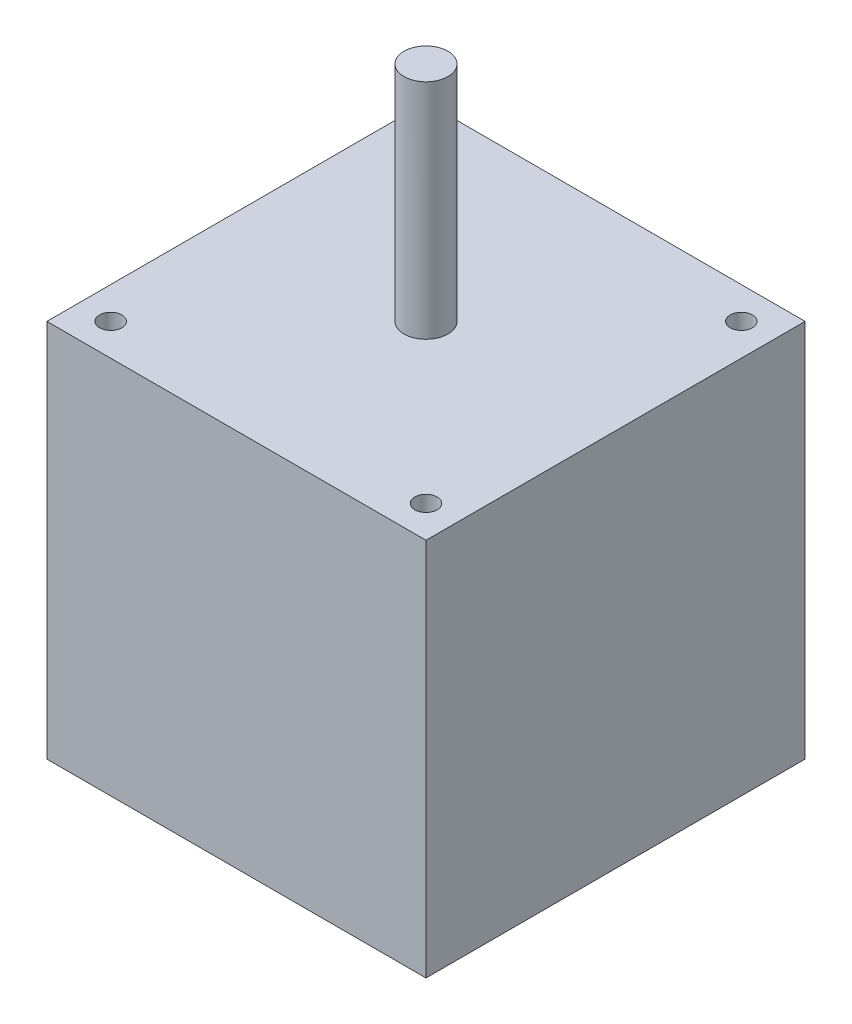
ISO-10303-21;
HEADER;
FILE_DESCRIPTION(('STEP AP214'),'2;1');
FILE_NAME('part.step','',(''),(''),'','','');
FILE_SCHEMA(('AUTOMOTIVE_DESIGN { 1 0 10303 214 1 1 1 1 }'));
ENDSEC;
DATA;
#1=APPLICATION_CONTEXT('core data for automotive mechanical design processes');
#2=APPLICATION_PROTOCOL_DEFINITION('international standard','automotive_design',2000,#1);
#3=PRODUCT_CONTEXT('',#1,'mechanical');
#4=PRODUCT('Part','Part','',(#3));
#5=PRODUCT_RELATED_PRODUCT_CATEGORY('part','',(#4));
#6=PRODUCT_DEFINITION_FORMATION('','',#4);
#7=PRODUCT_DEFINITION_CONTEXT('part definition',#1,'design');
#8=PRODUCT_DEFINITION('design','',#6,#7);
#9=PRODUCT_DEFINITION_SHAPE('','',#8);
#10=(LENGTH_UNIT() NAMED_UNIT(*) SI_UNIT(.MILLI.,.METRE.));
#11=(NAMED_UNIT(*) PLANE_ANGLE_UNIT() SI_UNIT($,.RADIAN.));
#12=(NAMED_UNIT(*) SI_UNIT($,.STERADIAN.) SOLID_ANGLE_UNIT());
#13=UNCERTAINTY_MEASURE_WITH_UNIT(LENGTH_MEASURE(1.E-05),#10,'distance_accuracy_value','');
#14=(GEOMETRIC_REPRESENTATION_CONTEXT(3) GLOBAL_UNCERTAINTY_ASSIGNED_CONTEXT((#13)) GLOBAL_UNIT_ASSIGNED_CONTEXT((#10,
#11,#12)) REPRESENTATION_CONTEXT('',''));
#15=CARTESIAN_POINT('',(0.,0.,0.));
#16=DIRECTION('',(0.,0.,1.));
#17=DIRECTION('',(1.,0.,0.));
#18=AXIS2_PLACEMENT_3D('',#15,#16,#17);
#19=CARTESIAN_POINT('',(17.9550877578617,-3.59210244842767,17.9550877578617));
#20=DIRECTION('',(0.,1.,0.));
#21=DIRECTION('',(0.,0.,1.));
#22=AXIS2_PLACEMENT_3D('',#19,#20,#21);
#23=CYLINDRICAL_SURFACE('',#22,1.27);
#24=CARTESIAN_POINT('',(17.9550877578617,43.18,17.9550877578617));
#25=DIRECTION('',(0.,1.,0.));
#26=DIRECTION('',(0.,0.,1.));
#27=AXIS2_PLACEMENT_3D('',#24,#25,#26);
#28=CIRCLE('',#27,1.27);
#29=CARTESIAN_POINT('',(17.9550877578617,43.18,19.2250877578617));
#30=VERTEX_POINT('',#29);
#31=EDGE_CURVE('E44',#30,#30,#28,.T.);
#32=ORIENTED_EDGE('',*,*,#31,.T.);
#33=EDGE_LOOP('',(#32));
#34=FACE_BOUND('',#33,.T.);
#35=CARTESIAN_POINT('',(17.9550877578617,0.,17.9550877578617));
#36=DIRECTION('',(0.,-1.,0.));
#37=DIRECTION('',(0.,0.,-1.));
#38=AXIS2_PLACEMENT_3D('',#35,#36,#37);
#39=CIRCLE('',#38,1.27);
#40=CARTESIAN_POINT('',(17.9550877578617,0.,16.6850877578617));
#41=VERTEX_POINT('',#40);
#42=EDGE_CURVE('E11',#41,#41,#39,.F.);
#43=ORIENTED_EDGE('',*,*,#42,.F.);
#44=EDGE_LOOP('',(#43));
#45=FACE_BOUND('',#44,.T.);
#46=ADVANCED_FACE('F36',(#34,#45),#23,.F.);
#47=CARTESIAN_POINT('',(-17.9605122421383,-3.59210244842767,17.9550877578617));
#48=DIRECTION('',(0.,1.,0.));
#49=DIRECTION('',(0.,0.,1.));
#50=AXIS2_PLACEMENT_3D('',#47,#48,#49);
#51=CYLINDRICAL_SURFACE('',#50,1.27);
#52=CARTESIAN_POINT('',(-17.9605122421383,43.18,17.9550877578617));
#53=DIRECTION('',(0.,1.,0.));
#54=DIRECTION('',(0.,0.,1.));
#55=AXIS2_PLACEMENT_3D('',#52,#53,#54);
#56=CIRCLE('',#55,1.27);
#57=CARTESIAN_POINT('',(-17.9605122421383,43.18,19.2250877578617));
#58=VERTEX_POINT('',#57);
#59=EDGE_CURVE('E117',#58,#58,#56,.T.);
#60=ORIENTED_EDGE('',*,*,#59,.T.);
#61=EDGE_LOOP('',(#60));
#62=FACE_BOUND('',#61,.T.);
#63=CARTESIAN_POINT('',(-17.9605122421383,0.,17.9550877578617));
#64=DIRECTION('',(0.,-1.,0.));
#65=DIRECTION('',(0.,0.,-1.));
#66=AXIS2_PLACEMENT_3D('',#63,#64,#65);
#67=CIRCLE('',#66,1.27);
#68=CARTESIAN_POINT('',(-17.9605122421383,0.,16.6850877578617));
#69=VERTEX_POINT('',#68);
#70=EDGE_CURVE('E120',#69,#69,#67,.F.);
#71=ORIENTED_EDGE('',*,*,#70,.F.);
#72=EDGE_LOOP('',(#71));
#73=FACE_BOUND('',#72,.T.);
#74=ADVANCED_FACE('F144',(#62,#73),#51,.F.);
#75=CARTESIAN_POINT('',(21.59,43.18,21.59));
#76=DIRECTION('',(-1.,0.,0.));
#77=DIRECTION('',(0.,0.,1.));
#78=AXIS2_PLACEMENT_3D('',#75,#76,#77);
#79=PLANE('',#78);
#80=DIRECTION('',(0.,0.,-1.));
#81=VECTOR('',#80,1.);
#82=CARTESIAN_POINT('',(21.59,0.,21.59));
#83=LINE('',#82,#81);
#84=CARTESIAN_POINT('',(21.59,0.,21.59));
#85=VERTEX_POINT('',#84);
#86=CARTESIAN_POINT('',(21.59,0.,-21.59));
#87=VERTEX_POINT('',#86);
#88=EDGE_CURVE('E104',#85,#87,#83,.T.);
#89=ORIENTED_EDGE('',*,*,#88,.T.);
#90=DIRECTION('',(0.,-1.,0.));
#91=VECTOR('',#90,1.);
#92=CARTESIAN_POINT('',(21.59,43.18,-21.59));
#93=LINE('',#92,#91);
#94=CARTESIAN_POINT('',(21.59,43.18,-21.59));
#95=VERTEX_POINT('',#94);
#96=EDGE_CURVE('E95',#95,#87,#93,.T.);
#97=ORIENTED_EDGE('',*,*,#96,.F.);
#98=DIRECTION('',(0.,0.,-1.));
#99=VECTOR('',#98,1.);
#100=CARTESIAN_POINT('',(21.59,43.18,21.59));
#101=LINE('',#100,#99);
#102=CARTESIAN_POINT('',(21.59,43.18,21.59));
#103=VERTEX_POINT('',#102);
#104=EDGE_CURVE('E89',#103,#95,#101,.T.);
#105=ORIENTED_EDGE('',*,*,#104,.F.);
#106=DIRECTION('',(0.,-1.,0.));
#107=VECTOR('',#106,1.);
#108=CARTESIAN_POINT('',(21.59,43.18,21.59));
#109=LINE('',#108,#107);
#110=EDGE_CURVE('E100',#103,#85,#109,.T.);
#111=ORIENTED_EDGE('',*,*,#110,.T.);
#112=EDGE_LOOP('',(#89,#97,#105,#111));
#113=FACE_BOUND('',#112,.T.);
#114=ADVANCED_FACE('F148',(#113),#79,.F.);
#115=CARTESIAN_POINT('',(-21.59,43.18,-21.59));
#116=DIRECTION('',(0.,0.,1.));
#117=DIRECTION('',(1.,0.,0.));
#118=AXIS2_PLACEMENT_3D('',#115,#116,#117);
#119=PLANE('',#118);
#120=DIRECTION('',(-1.,0.,0.));
#121=VECTOR('',#120,1.);
#122=CARTESIAN_POINT('',(-21.59,0.,-21.59));
#123=LINE('',#122,#121);
#124=CARTESIAN_POINT('',(-21.59,0.,-21.59));
#125=VERTEX_POINT('',#124);
#126=EDGE_CURVE('E94',#87,#125,#123,.T.);
#127=ORIENTED_EDGE('',*,*,#126,.T.);
#128=DIRECTION('',(0.,-1.,0.));
#129=VECTOR('',#128,1.);
#130=CARTESIAN_POINT('',(-21.59,43.18,-21.59));
#131=LINE('',#130,#129);
#132=CARTESIAN_POINT('',(-21.59,43.18,-21.59));
#133=VERTEX_POINT('',#132);
#134=EDGE_CURVE('E92',#133,#125,#131,.T.);
#135=ORIENTED_EDGE('',*,*,#134,.F.);
#136=DIRECTION('',(-1.,0.,0.));
#137=VECTOR('',#136,1.);
#138=CARTESIAN_POINT('',(-21.59,43.18,-21.59));
#139=LINE('',#138,#137);
#140=EDGE_CURVE('E83',#95,#133,#139,.T.);
#141=ORIENTED_EDGE('',*,*,#140,.F.);
#142=ORIENTED_EDGE('',*,*,#96,.T.);
#143=EDGE_LOOP('',(#127,#135,#141,#142));
#144=FACE_BOUND('',#143,.T.);
#145=ADVANCED_FACE('F93',(#144),#119,.F.);
#146=CARTESIAN_POINT('',(-21.59,43.18,21.59));
#147=DIRECTION('',(1.,0.,0.));
#148=DIRECTION('',(0.,0.,-1.));
#149=AXIS2_PLACEMENT_3D('',#146,#147,#148);
#150=PLANE('',#149);
#151=DIRECTION('',(0.,0.,1.));
#152=VECTOR('',#151,1.);
#153=CARTESIAN_POINT('',(-21.59,0.,21.59));
#154=LINE('',#153,#152);
#155=CARTESIAN_POINT('',(-21.59,0.,21.59));
#156=VERTEX_POINT('',#155);
#157=EDGE_CURVE('E69',#125,#156,#154,.T.);
#158=ORIENTED_EDGE('',*,*,#157,.T.);
#159=DIRECTION('',(0.,-1.,0.));
#160=VECTOR('',#159,1.);
#161=CARTESIAN_POINT('',(-21.59,43.18,21.59));
#162=LINE('',#161,#160);
#163=CARTESIAN_POINT('',(-21.59,43.18,21.59));
#164=VERTEX_POINT('',#163);
#165=EDGE_CURVE('E96',#164,#156,#162,.T.);
#166=ORIENTED_EDGE('',*,*,#165,.F.);
#167=DIRECTION('',(0.,0.,1.));
#168=VECTOR('',#167,1.);
#169=CARTESIAN_POINT('',(-21.59,43.18,21.59));
#170=LINE('',#169,#168);
#171=EDGE_CURVE('E87',#133,#164,#170,.T.);
#172=ORIENTED_EDGE('',*,*,#171,.F.);
#173=ORIENTED_EDGE('',*,*,#134,.T.);
#174=EDGE_LOOP('',(#158,#166,#172,#173));
#175=FACE_BOUND('',#174,.T.);
#176=ADVANCED_FACE('F98',(#175),#150,.F.);
#177=CARTESIAN_POINT('',(-21.59,43.18,21.59));
#178=DIRECTION('',(0.,0.,-1.));
#179=DIRECTION('',(-1.,0.,0.));
#180=AXIS2_PLACEMENT_3D('',#177,#178,#179);
#181=PLANE('',#180);
#182=DIRECTION('',(1.,0.,0.));
#183=VECTOR('',#182,1.);
#184=CARTESIAN_POINT('',(-21.59,0.,21.59));
#185=LINE('',#184,#183);
#186=EDGE_CURVE('E75',#156,#85,#185,.T.);
#187=ORIENTED_EDGE('',*,*,#186,.T.);
#188=ORIENTED_EDGE('',*,*,#110,.F.);
#189=DIRECTION('',(1.,0.,0.));
#190=VECTOR('',#189,1.);
#191=CARTESIAN_POINT('',(-21.59,43.18,21.59));
#192=LINE('',#191,#190);
#193=EDGE_CURVE('E52',#164,#103,#192,.T.);
#194=ORIENTED_EDGE('',*,*,#193,.F.);
#195=ORIENTED_EDGE('',*,*,#165,.T.);
#196=EDGE_LOOP('',(#187,#188,#194,#195));
#197=FACE_BOUND('',#196,.T.);
#198=ADVANCED_FACE('F129',(#197),#181,.F.);
#199=CARTESIAN_POINT('',(0.,43.18,0.));
#200=DIRECTION('',(0.,-1.,0.));
#201=DIRECTION('',(0.,0.,-1.));
#202=AXIS2_PLACEMENT_3D('',#199,#200,#201);
#203=PLANE('',#202);
#204=CARTESIAN_POINT('',(17.9550877578617,43.18,-17.9605122421383));
#205=DIRECTION('',(0.,1.,0.));
#206=DIRECTION('',(0.,0.,1.));
#207=AXIS2_PLACEMENT_3D('',#204,#205,#206);
#208=CIRCLE('',#207,1.27);
#209=CARTESIAN_POINT('',(17.9550877578617,43.18,-16.6905122421383));
#210=VERTEX_POINT('',#209);
#211=EDGE_CURVE('E230',#210,#210,#208,.T.);
#212=ORIENTED_EDGE('',*,*,#211,.F.);
#213=EDGE_LOOP('',(#212));
#214=FACE_BOUND('',#213,.T.);
#215=CARTESIAN_POINT('',(-17.9605122421383,43.18,-17.9605122421383));
#216=DIRECTION('',(0.,1.,0.));
#217=DIRECTION('',(0.,0.,1.));
#218=AXIS2_PLACEMENT_3D('',#215,#216,#217);
#219=CIRCLE('',#218,1.27);
#220=CARTESIAN_POINT('',(-17.9605122421383,43.18,-16.6905122421383));
#221=VERTEX_POINT('',#220);
#222=EDGE_CURVE('E234',#221,#221,#219,.T.);
#223=ORIENTED_EDGE('',*,*,#222,.F.);
#224=EDGE_LOOP('',(#223));
#225=FACE_BOUND('',#224,.T.);
#226=CARTESIAN_POINT('',(0.,43.18,0.));
#227=DIRECTION('',(0.,-1.,0.));
#228=DIRECTION('',(0.,0.,-1.));
#229=AXIS2_PLACEMENT_3D('',#226,#227,#228);
#230=CIRCLE('',#229,2.5);
#231=CARTESIAN_POINT('',(0.,43.18,-2.5));
#232=VERTEX_POINT('',#231);
#233=EDGE_CURVE('E114',#232,#232,#230,.F.);
#234=ORIENTED_EDGE('',*,*,#233,.F.);
#235=EDGE_LOOP('',(#234));
#236=FACE_BOUND('',#235,.T.);
#237=ORIENTED_EDGE('',*,*,#104,.T.);
#238=ORIENTED_EDGE('',*,*,#140,.T.);
#239=ORIENTED_EDGE('',*,*,#171,.T.);
#240=ORIENTED_EDGE('',*,*,#193,.T.);
#241=EDGE_LOOP('',(#237,#238,#239,#240));
#242=FACE_BOUND('',#241,.T.);
#243=ORIENTED_EDGE('',*,*,#59,.F.);
#244=EDGE_LOOP('',(#243));
#245=FACE_BOUND('',#244,.T.);
#246=ORIENTED_EDGE('',*,*,#31,.F.);
#247=EDGE_LOOP('',(#246));
#248=FACE_BOUND('',#247,.T.);
#249=ADVANCED_FACE('F84',(#214,#225,#236,#242,#245,#248),#203,.F.);
#250=CARTESIAN_POINT('',(0.,0.,0.));
#251=DIRECTION('',(0.,-1.,0.));
#252=DIRECTION('',(0.,0.,-1.));
#253=AXIS2_PLACEMENT_3D('',#250,#251,#252);
#254=PLANE('',#253);
#255=CARTESIAN_POINT('',(17.9550877578617,0.,-17.9605122421383));
#256=DIRECTION('',(0.,-1.,0.));
#257=DIRECTION('',(0.,0.,-1.));
#258=AXIS2_PLACEMENT_3D('',#255,#256,#257);
#259=CIRCLE('',#258,1.27);
#260=CARTESIAN_POINT('',(17.9550877578617,0.,-19.2305122421383));
#261=VERTEX_POINT('',#260);
#262=EDGE_CURVE('E233',#261,#261,#259,.F.);
#263=ORIENTED_EDGE('',*,*,#262,.T.);
#264=EDGE_LOOP('',(#263));
#265=FACE_BOUND('',#264,.T.);
#266=CARTESIAN_POINT('',(-17.9605122421383,0.,-17.9605122421383));
#267=DIRECTION('',(0.,-1.,0.));
#268=DIRECTION('',(0.,0.,-1.));
#269=AXIS2_PLACEMENT_3D('',#266,#267,#268);
#270=CIRCLE('',#269,1.27);
#271=CARTESIAN_POINT('',(-17.9605122421383,0.,-19.2305122421383));
#272=VERTEX_POINT('',#271);
#273=EDGE_CURVE('E237',#272,#272,#270,.F.);
#274=ORIENTED_EDGE('',*,*,#273,.T.);
#275=EDGE_LOOP('',(#274));
#276=FACE_BOUND('',#275,.T.);
#277=ORIENTED_EDGE('',*,*,#88,.F.);
#278=ORIENTED_EDGE('',*,*,#186,.F.);
#279=ORIENTED_EDGE('',*,*,#157,.F.);
#280=ORIENTED_EDGE('',*,*,#126,.F.);
#281=EDGE_LOOP('',(#277,#278,#279,#280));
#282=FACE_BOUND('',#281,.T.);
#283=ORIENTED_EDGE('',*,*,#70,.T.);
#284=EDGE_LOOP('',(#283));
#285=FACE_BOUND('',#284,.T.);
#286=ORIENTED_EDGE('',*,*,#42,.T.);
#287=EDGE_LOOP('',(#286));
#288=FACE_BOUND('',#287,.T.);
#289=ADVANCED_FACE('F128',(#265,#276,#282,#285,#288),#254,.T.);
#290=CARTESIAN_POINT('',(0.,68.58,0.));
#291=DIRECTION('',(0.,-1.,0.));
#292=DIRECTION('',(0.,0.,-1.));
#293=AXIS2_PLACEMENT_3D('',#290,#291,#292);
#294=CYLINDRICAL_SURFACE('',#293,2.5);
#295=CARTESIAN_POINT('',(0.,68.58,0.));
#296=DIRECTION('',(0.,1.,0.));
#297=DIRECTION('',(0.,0.,1.));
#298=AXIS2_PLACEMENT_3D('',#295,#296,#297);
#299=CIRCLE('',#298,2.5);
#300=CARTESIAN_POINT('',(0.,68.58,2.5));
#301=VERTEX_POINT('',#300);
#302=EDGE_CURVE('E107',#301,#301,#299,.T.);
#303=ORIENTED_EDGE('',*,*,#302,.F.);
#304=EDGE_LOOP('',(#303));
#305=FACE_BOUND('',#304,.T.);
#306=ORIENTED_EDGE('',*,*,#233,.T.);
#307=EDGE_LOOP('',(#306));
#308=FACE_BOUND('',#307,.T.);
#309=ADVANCED_FACE('F136',(#305,#308),#294,.T.);
#310=CARTESIAN_POINT('',(0.,68.58,0.));
#311=DIRECTION('',(0.,1.,0.));
#312=DIRECTION('',(0.,0.,1.));
#313=AXIS2_PLACEMENT_3D('',#310,#311,#312);
#314=PLANE('',#313);
#315=ORIENTED_EDGE('',*,*,#302,.T.);
#316=EDGE_LOOP('',(#315));
#317=FACE_BOUND('',#316,.T.);
#318=ADVANCED_FACE('F178',(#317),#314,.T.);
#319=CARTESIAN_POINT('',(-17.9605122421383,-3.59210244842767,-17.9605122421383));
#320=DIRECTION('',(0.,1.,0.));
#321=DIRECTION('',(0.,0.,1.));
#322=AXIS2_PLACEMENT_3D('',#319,#320,#321);
#323=CYLINDRICAL_SURFACE('',#322,1.27);
#324=ORIENTED_EDGE('',*,*,#222,.T.);
#325=EDGE_LOOP('',(#324));
#326=FACE_BOUND('',#325,.T.);
#327=ORIENTED_EDGE('',*,*,#273,.F.);
#328=EDGE_LOOP('',(#327));
#329=FACE_BOUND('',#328,.T.);
#330=ADVANCED_FACE('F188',(#326,#329),#323,.F.);
#331=CARTESIAN_POINT('',(17.9550877578617,-3.59210244842767,-17.9605122421383));
#332=DIRECTION('',(0.,1.,0.));
#333=DIRECTION('',(0.,0.,1.));
#334=AXIS2_PLACEMENT_3D('',#331,#332,#333);
#335=CYLINDRICAL_SURFACE('',#334,1.27);
#336=ORIENTED_EDGE('',*,*,#211,.T.);
#337=EDGE_LOOP('',(#336));
#338=FACE_BOUND('',#337,.T.);
#339=ORIENTED_EDGE('',*,*,#262,.F.);
#340=EDGE_LOOP('',(#339));
#341=FACE_BOUND('',#340,.T.);
#342=ADVANCED_FACE('F197',(#338,#341),#335,.F.);
#343=CLOSED_SHELL('',(#46,#74,#114,#145,#176,#198,#249,#289,#309,#318,#330,#342));
#344=MANIFOLD_SOLID_BREP('B2',#343);
#345=ADVANCED_BREP_SHAPE_REPRESENTATION('',(#18,#344),#14);
#346=SHAPE_DEFINITION_REPRESENTATION(#9,#345);
ENDSEC;
END-ISO-10303-21;
